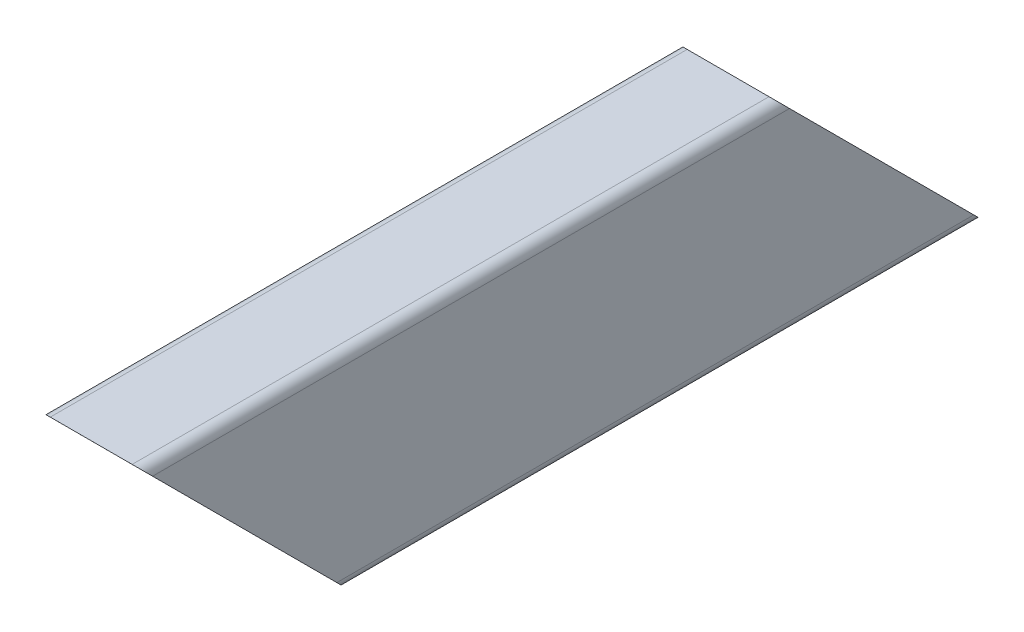
ISO-10303-21;
HEADER;
FILE_DESCRIPTION(('STEP AP214'),'2;1');
FILE_NAME('part.step','',(''),(''),'','','');
FILE_SCHEMA(('AUTOMOTIVE_DESIGN { 1 0 10303 214 1 1 1 1 }'));
ENDSEC;
DATA;
#1=APPLICATION_CONTEXT('core data for automotive mechanical design processes');
#2=APPLICATION_PROTOCOL_DEFINITION('international standard','automotive_design',2000,#1);
#3=PRODUCT_CONTEXT('',#1,'mechanical');
#4=PRODUCT('Part','Part','',(#3));
#5=PRODUCT_RELATED_PRODUCT_CATEGORY('part','',(#4));
#6=PRODUCT_DEFINITION_FORMATION('','',#4);
#7=PRODUCT_DEFINITION_CONTEXT('part definition',#1,'design');
#8=PRODUCT_DEFINITION('design','',#6,#7);
#9=PRODUCT_DEFINITION_SHAPE('','',#8);
#10=(LENGTH_UNIT() NAMED_UNIT(*) SI_UNIT(.MILLI.,.METRE.));
#11=(NAMED_UNIT(*) PLANE_ANGLE_UNIT() SI_UNIT($,.RADIAN.));
#12=(NAMED_UNIT(*) SI_UNIT($,.STERADIAN.) SOLID_ANGLE_UNIT());
#13=UNCERTAINTY_MEASURE_WITH_UNIT(LENGTH_MEASURE(1.E-05),#10,'distance_accuracy_value','');
#14=(GEOMETRIC_REPRESENTATION_CONTEXT(3) GLOBAL_UNCERTAINTY_ASSIGNED_CONTEXT((#13)) GLOBAL_UNIT_ASSIGNED_CONTEXT((#10,
#11,#12)) REPRESENTATION_CONTEXT('',''));
#15=CARTESIAN_POINT('',(0.,0.,0.));
#16=DIRECTION('',(0.,0.,1.));
#17=DIRECTION('',(1.,0.,0.));
#18=AXIS2_PLACEMENT_3D('',#15,#16,#17);
#19=CARTESIAN_POINT('',(-10.0000000000002,47.4999999999999,-205.56));
#20=DIRECTION('',(0.,0.,1.));
#21=DIRECTION('',(1.,0.,0.));
#22=AXIS2_PLACEMENT_3D('',#19,#20,#21);
#23=CYLINDRICAL_SURFACE('',#22,2.50000000000006);
#24=CARTESIAN_POINT('',(-10.0000000000002,47.4999999999999,-2.49650813862906));
#25=DIRECTION('',(0.,0.707106781186546,-0.707106781186549));
#26=DIRECTION('',(0.,0.707106781186549,0.707106781186546));
#27=AXIS2_PLACEMENT_3D('',#24,#25,#26);
#28=ELLIPSE('',#27,3.53553390593281,2.50000000000006);
#29=CARTESIAN_POINT('',(-10.1320875231025,49.9965081386289,0.));
#30=VERTEX_POINT('',#29);
#31=CARTESIAN_POINT('',(-12.5000000000002,47.4999999999999,-2.49650813862902));
#32=VERTEX_POINT('',#31);
#33=EDGE_CURVE('E149',#30,#32,#28,.F.);
#34=ORIENTED_EDGE('',*,*,#33,.F.);
#35=CARTESIAN_POINT('',(-10.0000000000002,47.4999999999999,0.));
#36=DIRECTION('',(0.,0.,1.));
#37=DIRECTION('',(1.,0.,0.));
#38=AXIS2_PLACEMENT_3D('',#35,#36,#37);
#39=CIRCLE('',#38,2.50000000000006);
#40=CARTESIAN_POINT('',(-10.0000000000002,50.,0.));
#41=VERTEX_POINT('',#40);
#42=EDGE_CURVE('E282',#41,#30,#39,.T.);
#43=ORIENTED_EDGE('',*,*,#42,.F.);
#44=DIRECTION('',(0.,0.,1.));
#45=VECTOR('',#44,1.);
#46=CARTESIAN_POINT('',(-10.0000000000002,50.,-205.56));
#47=LINE('',#46,#45);
#48=CARTESIAN_POINT('',(-10.0000000000002,50.0000000000824,-155.559999999445));
#49=VERTEX_POINT('',#48);
#50=EDGE_CURVE('E183',#49,#41,#47,.T.);
#51=ORIENTED_EDGE('',*,*,#50,.F.);
#52=CARTESIAN_POINT('',(-10.0000000000002,47.4999999999999,-158.059999999528));
#53=DIRECTION('',(0.,-0.707106781186546,0.707106781186549));
#54=DIRECTION('',(0.,0.707106781186549,0.707106781186546));
#55=AXIS2_PLACEMENT_3D('',#52,#53,#54);
#56=ELLIPSE('',#55,3.53553390593281,2.50000000000006);
#57=CARTESIAN_POINT('',(-12.5000000000002,47.4999999999999,-158.059999999528));
#58=VERTEX_POINT('',#57);
#59=EDGE_CURVE('E173',#58,#49,#56,.F.);
#60=ORIENTED_EDGE('',*,*,#59,.F.);
#61=DIRECTION('',(0.,0.,1.));
#62=VECTOR('',#61,1.);
#63=CARTESIAN_POINT('',(-12.5000000000002,47.4999999999999,-205.56));
#64=LINE('',#63,#62);
#65=EDGE_CURVE('E166',#58,#32,#64,.T.);
#66=ORIENTED_EDGE('',*,*,#65,.T.);
#67=EDGE_LOOP('',(#34,#43,#51,#60,#66));
#68=FACE_BOUND('',#67,.T.);
#69=ADVANCED_FACE('F34',(#68),#23,.T.);
#70=CARTESIAN_POINT('',(-10.0000000000002,50.,-205.56));
#71=DIRECTION('',(0.,1.,0.));
#72=DIRECTION('',(0.,0.,1.));
#73=AXIS2_PLACEMENT_3D('',#70,#71,#72);
#74=PLANE('',#73);
#75=DIRECTION('',(-1.,0.,0.));
#76=VECTOR('',#75,1.);
#77=CARTESIAN_POINT('',(37.4999999999998,50.0000000000824,-155.559999999445));
#78=LINE('',#77,#76);
#79=CARTESIAN_POINT('',(9.99999999999934,50.0000000000002,-155.559999999528));
#80=VERTEX_POINT('',#79);
#81=EDGE_CURVE('E247',#80,#49,#78,.T.);
#82=ORIENTED_EDGE('',*,*,#81,.T.);
#83=ORIENTED_EDGE('',*,*,#50,.T.);
#84=DIRECTION('',(-1.,0.,0.));
#85=VECTOR('',#84,1.);
#86=CARTESIAN_POINT('',(-10.0000000000002,50.,0.));
#87=LINE('',#86,#85);
#88=CARTESIAN_POINT('',(9.99999999999979,50.,0.));
#89=VERTEX_POINT('',#88);
#90=EDGE_CURVE('E179',#89,#41,#87,.T.);
#91=ORIENTED_EDGE('',*,*,#90,.F.);
#92=DIRECTION('',(0.,0.,1.));
#93=VECTOR('',#92,1.);
#94=CARTESIAN_POINT('',(9.99999999999979,50.,-205.56));
#95=LINE('',#94,#93);
#96=EDGE_CURVE('E188',#80,#89,#95,.T.);
#97=ORIENTED_EDGE('',*,*,#96,.F.);
#98=EDGE_LOOP('',(#82,#83,#91,#97));
#99=FACE_BOUND('',#98,.T.);
#100=ADVANCED_FACE('F308',(#99),#74,.T.);
#101=CARTESIAN_POINT('',(9.99999999999934,47.4999999999999,-205.56));
#102=DIRECTION('',(0.,0.,1.));
#103=DIRECTION('',(1.,0.,0.));
#104=AXIS2_PLACEMENT_3D('',#101,#102,#103);
#105=CYLINDRICAL_SURFACE('',#104,2.50000000000028);
#106=CARTESIAN_POINT('',(9.99999999999934,47.4999999999999,-2.49650813862906));
#107=DIRECTION('',(0.,0.707106781186546,-0.707106781186549));
#108=DIRECTION('',(0.,0.707106781186549,0.707106781186546));
#109=AXIS2_PLACEMENT_3D('',#106,#107,#108);
#110=ELLIPSE('',#109,3.53553390593313,2.50000000000028);
#111=CARTESIAN_POINT('',(12.4999999999996,47.4999999999999,-2.49650813862906));
#112=VERTEX_POINT('',#111);
#113=CARTESIAN_POINT('',(10.1320875231058,49.9965081386289,0.));
#114=VERTEX_POINT('',#113);
#115=EDGE_CURVE('E48',#112,#114,#110,.F.);
#116=ORIENTED_EDGE('',*,*,#115,.F.);
#117=DIRECTION('',(0.,0.,1.));
#118=VECTOR('',#117,1.);
#119=CARTESIAN_POINT('',(12.4999999999996,47.4999999999999,-205.56));
#120=LINE('',#119,#118);
#121=CARTESIAN_POINT('',(12.4999999999997,47.4999999999999,-158.059999999528));
#122=VERTEX_POINT('',#121);
#123=EDGE_CURVE('E194',#122,#112,#120,.T.);
#124=ORIENTED_EDGE('',*,*,#123,.F.);
#125=CARTESIAN_POINT('',(9.99999999999934,47.4999999999999,-158.059999999528));
#126=DIRECTION('',(0.,-0.707106781186546,0.707106781186549));
#127=DIRECTION('',(0.,0.707106781186549,0.707106781186546));
#128=AXIS2_PLACEMENT_3D('',#125,#126,#127);
#129=ELLIPSE('',#128,3.53553390593313,2.50000000000028);
#130=EDGE_CURVE('E275',#80,#122,#129,.F.);
#131=ORIENTED_EDGE('',*,*,#130,.F.);
#132=ORIENTED_EDGE('',*,*,#96,.T.);
#133=CARTESIAN_POINT('',(9.99999999999934,47.4999999999999,0.));
#134=DIRECTION('',(0.,0.,1.));
#135=DIRECTION('',(1.,0.,0.));
#136=AXIS2_PLACEMENT_3D('',#133,#134,#135);
#137=CIRCLE('',#136,2.50000000000028);
#138=EDGE_CURVE('E302',#114,#89,#137,.T.);
#139=ORIENTED_EDGE('',*,*,#138,.F.);
#140=EDGE_LOOP('',(#116,#124,#131,#132,#139));
#141=FACE_BOUND('',#140,.T.);
#142=ADVANCED_FACE('F311',(#141),#105,.T.);
#143=CARTESIAN_POINT('',(12.4999999999997,47.4999999999999,-205.56));
#144=DIRECTION('',(1.,0.,0.));
#145=DIRECTION('',(0.,0.,-1.));
#146=AXIS2_PLACEMENT_3D('',#143,#144,#145);
#147=PLANE('',#146);
#148=DIRECTION('',(0.,0.707106781186549,0.707106781186546));
#149=VECTOR('',#148,1.);
#150=CARTESIAN_POINT('',(12.4999999999997,-54.0317459306856,-104.028254069314));
#151=LINE('',#150,#149);
#152=CARTESIAN_POINT('',(12.4999999999997,2.49999999999995,-47.4965081386288));
#153=VERTEX_POINT('',#152);
#154=EDGE_CURVE('E159',#153,#112,#151,.T.);
#155=ORIENTED_EDGE('',*,*,#154,.F.);
#156=DIRECTION('',(0.,0.,1.));
#157=VECTOR('',#156,1.);
#158=CARTESIAN_POINT('',(12.4999999999997,2.49999999999995,-205.56));
#159=LINE('',#158,#157);
#160=CARTESIAN_POINT('',(12.4999999999997,2.49999999999995,-203.059999999528));
#161=VERTEX_POINT('',#160);
#162=EDGE_CURVE('E201',#161,#153,#159,.T.);
#163=ORIENTED_EDGE('',*,*,#162,.F.);
#164=DIRECTION('',(0.,-0.707106781186549,-0.707106781186546));
#165=VECTOR('',#164,1.);
#166=CARTESIAN_POINT('',(12.4999999999997,23.7499999997638,-181.809999999764));
#167=LINE('',#166,#165);
#168=EDGE_CURVE('E273',#122,#161,#167,.T.);
#169=ORIENTED_EDGE('',*,*,#168,.F.);
#170=ORIENTED_EDGE('',*,*,#123,.T.);
#171=EDGE_LOOP('',(#155,#163,#169,#170));
#172=FACE_BOUND('',#171,.T.);
#173=ADVANCED_FACE('F321',(#172),#147,.T.);
#174=CARTESIAN_POINT('',(9.99999999999934,2.49999999999995,-205.56));
#175=DIRECTION('',(0.,0.,1.));
#176=DIRECTION('',(1.,0.,0.));
#177=AXIS2_PLACEMENT_3D('',#174,#175,#176);
#178=CYLINDRICAL_SURFACE('',#177,2.50000000000017);
#179=CARTESIAN_POINT('',(9.99999999999934,2.49999999999995,-47.4965081386288));
#180=DIRECTION('',(0.,0.707106781186546,-0.707106781186549));
#181=DIRECTION('',(0.,0.707106781186549,0.707106781186546));
#182=AXIS2_PLACEMENT_3D('',#179,#180,#181);
#183=ELLIPSE('',#182,3.53553390593297,2.50000000000017);
#184=CARTESIAN_POINT('',(9.99999999999934,-1.50879309046559E-10,-49.9965081387796));
#185=VERTEX_POINT('',#184);
#186=EDGE_CURVE('E242',#185,#153,#183,.F.);
#187=ORIENTED_EDGE('',*,*,#186,.F.);
#188=DIRECTION('',(0.,0.,1.));
#189=VECTOR('',#188,1.);
#190=CARTESIAN_POINT('',(9.99999999999934,-2.22044604925031E-13,-205.56));
#191=LINE('',#190,#189);
#192=CARTESIAN_POINT('',(9.99999999999934,-2.22044604925031E-13,-205.56));
#193=VERTEX_POINT('',#192);
#194=EDGE_CURVE('E204',#193,#185,#191,.T.);
#195=ORIENTED_EDGE('',*,*,#194,.F.);
#196=CARTESIAN_POINT('',(9.99999999999934,2.49999999999995,-203.059999999528));
#197=DIRECTION('',(0.,-0.707106781186546,0.707106781186549));
#198=DIRECTION('',(0.,0.707106781186549,0.707106781186546));
#199=AXIS2_PLACEMENT_3D('',#196,#197,#198);
#200=ELLIPSE('',#199,3.53553390593297,2.50000000000017);
#201=EDGE_CURVE('E271',#161,#193,#200,.F.);
#202=ORIENTED_EDGE('',*,*,#201,.F.);
#203=ORIENTED_EDGE('',*,*,#162,.T.);
#204=EDGE_LOOP('',(#187,#195,#202,#203));
#205=FACE_BOUND('',#204,.T.);
#206=ADVANCED_FACE('F323',(#205),#178,.T.);
#207=CARTESIAN_POINT('',(9.99999999999934,0.,-205.56));
#208=DIRECTION('',(0.,-1.,0.));
#209=DIRECTION('',(0.,0.,-1.));
#210=AXIS2_PLACEMENT_3D('',#207,#208,#209);
#211=PLANE('',#210);
#212=DIRECTION('',(-1.,0.,0.));
#213=VECTOR('',#212,1.);
#214=CARTESIAN_POINT('',(37.4999999999998,-1.50879309046559E-10,-49.9965081387796));
#215=LINE('',#214,#213);
#216=CARTESIAN_POINT('',(-10.0000000000002,0.,-49.9965081386288));
#217=VERTEX_POINT('',#216);
#218=EDGE_CURVE('E169',#185,#217,#215,.T.);
#219=ORIENTED_EDGE('',*,*,#218,.T.);
#220=DIRECTION('',(0.,0.,1.));
#221=VECTOR('',#220,1.);
#222=CARTESIAN_POINT('',(-10.0000000000002,0.,-205.56));
#223=LINE('',#222,#221);
#224=CARTESIAN_POINT('',(-10.0000000000002,-1.51129109227099E-10,-205.559999999679));
#225=VERTEX_POINT('',#224);
#226=EDGE_CURVE('E176',#225,#217,#223,.T.);
#227=ORIENTED_EDGE('',*,*,#226,.F.);
#228=DIRECTION('',(1.,0.,0.));
#229=VECTOR('',#228,1.);
#230=CARTESIAN_POINT('',(9.99999999999934,0.,-205.56));
#231=LINE('',#230,#229);
#232=EDGE_CURVE('E174',#225,#193,#231,.T.);
#233=ORIENTED_EDGE('',*,*,#232,.T.);
#234=ORIENTED_EDGE('',*,*,#194,.T.);
#235=EDGE_LOOP('',(#219,#227,#233,#234));
#236=FACE_BOUND('',#235,.T.);
#237=ADVANCED_FACE('F215',(#236),#211,.T.);
#238=CARTESIAN_POINT('',(-10.0000000000002,2.49999999999995,-205.56));
#239=DIRECTION('',(0.,0.,1.));
#240=DIRECTION('',(1.,0.,0.));
#241=AXIS2_PLACEMENT_3D('',#238,#239,#240);
#242=CYLINDRICAL_SURFACE('',#241,2.49999999999995);
#243=CARTESIAN_POINT('',(-10.0000000000002,2.49999999999995,-47.4965081386288));
#244=DIRECTION('',(0.,0.707106781186546,-0.707106781186549));
#245=DIRECTION('',(0.,0.707106781186549,0.707106781186546));
#246=AXIS2_PLACEMENT_3D('',#243,#244,#245);
#247=ELLIPSE('',#246,3.53553390593266,2.49999999999995);
#248=CARTESIAN_POINT('',(-12.5000000000002,2.49999999999995,-47.4965081386288));
#249=VERTEX_POINT('',#248);
#250=EDGE_CURVE('E211',#249,#217,#247,.F.);
#251=ORIENTED_EDGE('',*,*,#250,.F.);
#252=DIRECTION('',(0.,0.,1.));
#253=VECTOR('',#252,1.);
#254=CARTESIAN_POINT('',(-12.5000000000002,2.49999999999995,-205.56));
#255=LINE('',#254,#253);
#256=CARTESIAN_POINT('',(-12.5000000000002,2.49999999999996,-203.059999999528));
#257=VERTEX_POINT('',#256);
#258=EDGE_CURVE('E168',#257,#249,#255,.T.);
#259=ORIENTED_EDGE('',*,*,#258,.F.);
#260=CARTESIAN_POINT('',(-10.0000000000002,2.49999999999995,-203.059999999528));
#261=DIRECTION('',(0.,-0.707106781186546,0.707106781186549));
#262=DIRECTION('',(0.,0.707106781186549,0.707106781186546));
#263=AXIS2_PLACEMENT_3D('',#260,#261,#262);
#264=ELLIPSE('',#263,3.53553390593266,2.49999999999995);
#265=EDGE_CURVE('E212',#225,#257,#264,.F.);
#266=ORIENTED_EDGE('',*,*,#265,.F.);
#267=ORIENTED_EDGE('',*,*,#226,.T.);
#268=EDGE_LOOP('',(#251,#259,#266,#267));
#269=FACE_BOUND('',#268,.T.);
#270=ADVANCED_FACE('F210',(#269),#242,.T.);
#271=CARTESIAN_POINT('',(-12.5000000000002,2.49999999999995,-205.56));
#272=DIRECTION('',(-1.,0.,0.));
#273=DIRECTION('',(0.,0.,1.));
#274=AXIS2_PLACEMENT_3D('',#271,#272,#273);
#275=PLANE('',#274);
#276=DIRECTION('',(0.,-0.707106781186549,-0.707106781186546));
#277=VECTOR('',#276,1.);
#278=CARTESIAN_POINT('',(-12.5000000000002,-1.50879309046559E-10,-49.9965081387796));
#279=LINE('',#278,#277);
#280=EDGE_CURVE('E152',#32,#249,#279,.T.);
#281=ORIENTED_EDGE('',*,*,#280,.F.);
#282=ORIENTED_EDGE('',*,*,#65,.F.);
#283=DIRECTION('',(0.,0.707106781186549,0.707106781186546));
#284=VECTOR('',#283,1.);
#285=CARTESIAN_POINT('',(-12.5000000000002,50.0000000000824,-155.559999999445));
#286=LINE('',#285,#284);
#287=EDGE_CURVE('E245',#257,#58,#286,.T.);
#288=ORIENTED_EDGE('',*,*,#287,.F.);
#289=ORIENTED_EDGE('',*,*,#258,.T.);
#290=EDGE_LOOP('',(#281,#282,#288,#289));
#291=FACE_BOUND('',#290,.T.);
#292=ADVANCED_FACE('F164',(#291),#275,.T.);
#293=CARTESIAN_POINT('',(-10.0000000000002,47.4999999999999,0.));
#294=DIRECTION('',(0.,0.,1.));
#295=DIRECTION('',(1.,0.,0.));
#296=AXIS2_PLACEMENT_3D('',#293,#294,#295);
#297=PLANE('',#296);
#298=DIRECTION('',(-1.,0.,0.));
#299=VECTOR('',#298,1.);
#300=CARTESIAN_POINT('',(-10.0000000000002,49.9965081386289,0.));
#301=LINE('',#300,#299);
#302=EDGE_CURVE('E154',#114,#30,#301,.T.);
#303=ORIENTED_EDGE('',*,*,#302,.F.);
#304=ORIENTED_EDGE('',*,*,#138,.T.);
#305=ORIENTED_EDGE('',*,*,#90,.T.);
#306=ORIENTED_EDGE('',*,*,#42,.T.);
#307=EDGE_LOOP('',(#303,#304,#305,#306));
#308=FACE_BOUND('',#307,.T.);
#309=ADVANCED_FACE('F306',(#308),#297,.T.);
#310=CARTESIAN_POINT('',(-7.49999999999984,44.9999999999999,-205.56));
#311=DIRECTION('',(0.,0.,1.));
#312=DIRECTION('',(1.,0.,0.));
#313=AXIS2_PLACEMENT_3D('',#310,#311,#312);
#314=CYLINDRICAL_SURFACE('',#313,2.50000000000017);
#315=DIRECTION('',(0.,0.,1.));
#316=VECTOR('',#315,1.);
#317=CARTESIAN_POINT('',(-7.50000000000028,47.4999999999999,-205.56));
#318=LINE('',#317,#316);
#319=CARTESIAN_POINT('',(-7.50000000000028,47.4999999999999,-158.059999999528));
#320=VERTEX_POINT('',#319);
#321=CARTESIAN_POINT('',(-7.50000000000028,47.4999999999999,-2.49650813862906));
#322=VERTEX_POINT('',#321);
#323=EDGE_CURVE('E279',#320,#322,#318,.T.);
#324=ORIENTED_EDGE('',*,*,#323,.T.);
#325=CARTESIAN_POINT('',(-7.49999999999984,44.9999999999999,-4.99650813862898));
#326=DIRECTION('',(0.,0.707106781186546,-0.707106781186549));
#327=DIRECTION('',(0.,0.707106781186549,0.707106781186546));
#328=AXIS2_PLACEMENT_3D('',#325,#326,#327);
#329=ELLIPSE('',#328,3.53553390593297,2.50000000000017);
#330=CARTESIAN_POINT('',(-10.0000000000002,44.9999999999999,-4.99650813862894));
#331=VERTEX_POINT('',#330);
#332=EDGE_CURVE('E236',#322,#331,#329,.F.);
#333=ORIENTED_EDGE('',*,*,#332,.T.);
#334=DIRECTION('',(0.,0.,1.));
#335=VECTOR('',#334,1.);
#336=CARTESIAN_POINT('',(-10.0000000000002,44.9999999999999,-205.56));
#337=LINE('',#336,#335);
#338=CARTESIAN_POINT('',(-10.0000000000002,44.9999999999999,-160.559999999528));
#339=VERTEX_POINT('',#338);
#340=EDGE_CURVE('E278',#339,#331,#337,.T.);
#341=ORIENTED_EDGE('',*,*,#340,.F.);
#342=CARTESIAN_POINT('',(-7.49999999999984,44.9999999999999,-160.559999999528));
#343=DIRECTION('',(0.,-0.707106781186546,0.707106781186549));
#344=DIRECTION('',(0.,0.707106781186549,0.707106781186546));
#345=AXIS2_PLACEMENT_3D('',#342,#343,#344);
#346=ELLIPSE('',#345,3.53553390593297,2.50000000000017);
#347=EDGE_CURVE('E267',#339,#320,#346,.F.);
#348=ORIENTED_EDGE('',*,*,#347,.T.);
#349=EDGE_LOOP('',(#324,#333,#341,#348));
#350=FACE_BOUND('',#349,.T.);
#351=ADVANCED_FACE('F344',(#350),#314,.F.);
#352=CARTESIAN_POINT('',(-7.50000000000028,47.4999999999999,-205.56));
#353=DIRECTION('',(0.,1.,0.));
#354=DIRECTION('',(0.,0.,1.));
#355=AXIS2_PLACEMENT_3D('',#352,#353,#354);
#356=PLANE('',#355);
#357=DIRECTION('',(0.,0.,1.));
#358=VECTOR('',#357,1.);
#359=CARTESIAN_POINT('',(7.49999999999984,47.4999999999999,-205.56));
#360=LINE('',#359,#358);
#361=CARTESIAN_POINT('',(7.49999999999984,47.4999999999999,-158.059999999528));
#362=VERTEX_POINT('',#361);
#363=CARTESIAN_POINT('',(7.49999999999984,47.4999999999999,-2.49650813862906));
#364=VERTEX_POINT('',#363);
#365=EDGE_CURVE('E283',#362,#364,#360,.T.);
#366=ORIENTED_EDGE('',*,*,#365,.T.);
#367=DIRECTION('',(-1.,0.,0.));
#368=VECTOR('',#367,1.);
#369=CARTESIAN_POINT('',(-7.50000000000028,47.4999999999999,-2.49650813862906));
#370=LINE('',#369,#368);
#371=EDGE_CURVE('E233',#364,#322,#370,.T.);
#372=ORIENTED_EDGE('',*,*,#371,.T.);
#373=ORIENTED_EDGE('',*,*,#323,.F.);
#374=DIRECTION('',(1.,0.,0.));
#375=VECTOR('',#374,1.);
#376=CARTESIAN_POINT('',(-7.50000000000028,47.4999999999999,-158.059999999528));
#377=LINE('',#376,#375);
#378=EDGE_CURVE('E264',#320,#362,#377,.T.);
#379=ORIENTED_EDGE('',*,*,#378,.T.);
#380=EDGE_LOOP('',(#366,#372,#373,#379));
#381=FACE_BOUND('',#380,.T.);
#382=ADVANCED_FACE('F347',(#381),#356,.F.);
#383=CARTESIAN_POINT('',(7.49999999999984,44.9999999999999,-205.56));
#384=DIRECTION('',(0.,0.,1.));
#385=DIRECTION('',(1.,0.,0.));
#386=AXIS2_PLACEMENT_3D('',#383,#384,#385);
#387=CYLINDRICAL_SURFACE('',#386,2.49999999999995);
#388=DIRECTION('',(0.,0.,1.));
#389=VECTOR('',#388,1.);
#390=CARTESIAN_POINT('',(9.99999999999979,44.9999999999999,-205.56));
#391=LINE('',#390,#389);
#392=CARTESIAN_POINT('',(9.99999999999979,44.9999999999999,-160.559999999528));
#393=VERTEX_POINT('',#392);
#394=CARTESIAN_POINT('',(9.99999999999979,44.9999999999999,-4.99650813862894));
#395=VERTEX_POINT('',#394);
#396=EDGE_CURVE('E286',#393,#395,#391,.T.);
#397=ORIENTED_EDGE('',*,*,#396,.T.);
#398=CARTESIAN_POINT('',(7.49999999999984,44.9999999999999,-4.99650813862898));
#399=DIRECTION('',(0.,0.707106781186546,-0.707106781186549));
#400=DIRECTION('',(0.,0.707106781186549,0.707106781186546));
#401=AXIS2_PLACEMENT_3D('',#398,#399,#400);
#402=ELLIPSE('',#401,3.53553390593266,2.49999999999995);
#403=EDGE_CURVE('E230',#395,#364,#402,.F.);
#404=ORIENTED_EDGE('',*,*,#403,.T.);
#405=ORIENTED_EDGE('',*,*,#365,.F.);
#406=CARTESIAN_POINT('',(7.49999999999984,44.9999999999999,-160.559999999528));
#407=DIRECTION('',(0.,-0.707106781186546,0.707106781186549));
#408=DIRECTION('',(0.,0.707106781186549,0.707106781186546));
#409=AXIS2_PLACEMENT_3D('',#406,#407,#408);
#410=ELLIPSE('',#409,3.53553390593266,2.49999999999995);
#411=EDGE_CURVE('E261',#362,#393,#410,.F.);
#412=ORIENTED_EDGE('',*,*,#411,.T.);
#413=EDGE_LOOP('',(#397,#404,#405,#412));
#414=FACE_BOUND('',#413,.T.);
#415=ADVANCED_FACE('F367',(#414),#387,.F.);
#416=CARTESIAN_POINT('',(9.99999999999979,44.9999999999999,-205.56));
#417=DIRECTION('',(1.,0.,0.));
#418=DIRECTION('',(0.,0.,-1.));
#419=AXIS2_PLACEMENT_3D('',#416,#417,#418);
#420=PLANE('',#419);
#421=DIRECTION('',(0.,0.,1.));
#422=VECTOR('',#421,1.);
#423=CARTESIAN_POINT('',(9.99999999999979,4.99999999999989,-205.56));
#424=LINE('',#423,#422);
#425=CARTESIAN_POINT('',(9.99999999999979,4.99999999999989,-200.559999999528));
#426=VERTEX_POINT('',#425);
#427=CARTESIAN_POINT('',(9.99999999999979,4.99999999999989,-44.9965081386289));
#428=VERTEX_POINT('',#427);
#429=EDGE_CURVE('E289',#426,#428,#424,.T.);
#430=ORIENTED_EDGE('',*,*,#429,.T.);
#431=DIRECTION('',(0.,0.707106781186549,0.707106781186546));
#432=VECTOR('',#431,1.);
#433=CARTESIAN_POINT('',(9.99999999999979,-55.2817459306856,-105.278254069314));
#434=LINE('',#433,#432);
#435=EDGE_CURVE('E227',#428,#395,#434,.T.);
#436=ORIENTED_EDGE('',*,*,#435,.T.);
#437=ORIENTED_EDGE('',*,*,#396,.F.);
#438=DIRECTION('',(0.,-0.707106781186549,-0.707106781186546));
#439=VECTOR('',#438,1.);
#440=CARTESIAN_POINT('',(9.99999999999979,22.4999999997638,-183.059999999764));
#441=LINE('',#440,#439);
#442=EDGE_CURVE('E258',#393,#426,#441,.T.);
#443=ORIENTED_EDGE('',*,*,#442,.T.);
#444=EDGE_LOOP('',(#430,#436,#437,#443));
#445=FACE_BOUND('',#444,.T.);
#446=ADVANCED_FACE('F363',(#445),#420,.F.);
#447=CARTESIAN_POINT('',(7.49999999999984,4.99999999999989,-205.56));
#448=DIRECTION('',(0.,0.,1.));
#449=DIRECTION('',(1.,0.,0.));
#450=AXIS2_PLACEMENT_3D('',#447,#448,#449);
#451=CYLINDRICAL_SURFACE('',#450,2.49999999999995);
#452=DIRECTION('',(0.,0.,1.));
#453=VECTOR('',#452,1.);
#454=CARTESIAN_POINT('',(7.49999999999984,2.49999999999995,-205.56));
#455=LINE('',#454,#453);
#456=CARTESIAN_POINT('',(7.49999999999984,2.49999999999995,-203.059999999528));
#457=VERTEX_POINT('',#456);
#458=CARTESIAN_POINT('',(7.49999999999984,2.49999999999995,-47.4965081386288));
#459=VERTEX_POINT('',#458);
#460=EDGE_CURVE('E292',#457,#459,#455,.T.);
#461=ORIENTED_EDGE('',*,*,#460,.T.);
#462=CARTESIAN_POINT('',(7.49999999999984,4.99999999999989,-44.9965081386289));
#463=DIRECTION('',(0.,0.707106781186546,-0.707106781186549));
#464=DIRECTION('',(0.,0.707106781186549,0.707106781186546));
#465=AXIS2_PLACEMENT_3D('',#462,#463,#464);
#466=ELLIPSE('',#465,3.53553390593266,2.49999999999995);
#467=EDGE_CURVE('E224',#459,#428,#466,.F.);
#468=ORIENTED_EDGE('',*,*,#467,.T.);
#469=ORIENTED_EDGE('',*,*,#429,.F.);
#470=CARTESIAN_POINT('',(7.49999999999984,4.99999999999989,-200.559999999528));
#471=DIRECTION('',(0.,-0.707106781186546,0.707106781186549));
#472=DIRECTION('',(0.,0.707106781186549,0.707106781186546));
#473=AXIS2_PLACEMENT_3D('',#470,#471,#472);
#474=ELLIPSE('',#473,3.53553390593266,2.49999999999995);
#475=EDGE_CURVE('E255',#426,#457,#474,.F.);
#476=ORIENTED_EDGE('',*,*,#475,.T.);
#477=EDGE_LOOP('',(#461,#468,#469,#476));
#478=FACE_BOUND('',#477,.T.);
#479=ADVANCED_FACE('F359',(#478),#451,.F.);
#480=CARTESIAN_POINT('',(7.49999999999984,2.49999999999995,-205.56));
#481=DIRECTION('',(0.,-1.,0.));
#482=DIRECTION('',(0.,0.,-1.));
#483=AXIS2_PLACEMENT_3D('',#480,#481,#482);
#484=PLANE('',#483);
#485=DIRECTION('',(0.,0.,1.));
#486=VECTOR('',#485,1.);
#487=CARTESIAN_POINT('',(-7.50000000000028,2.49999999999995,-205.56));
#488=LINE('',#487,#486);
#489=CARTESIAN_POINT('',(-7.50000000000028,2.49999999999995,-203.059999999528));
#490=VERTEX_POINT('',#489);
#491=CARTESIAN_POINT('',(-7.50000000000028,2.49999999999995,-47.4965081386288));
#492=VERTEX_POINT('',#491);
#493=EDGE_CURVE('E295',#490,#492,#488,.T.);
#494=ORIENTED_EDGE('',*,*,#493,.T.);
#495=DIRECTION('',(1.,0.,0.));
#496=VECTOR('',#495,1.);
#497=CARTESIAN_POINT('',(7.49999999999984,2.49999999999995,-47.4965081386288));
#498=LINE('',#497,#496);
#499=EDGE_CURVE('E219',#492,#459,#498,.T.);
#500=ORIENTED_EDGE('',*,*,#499,.T.);
#501=ORIENTED_EDGE('',*,*,#460,.F.);
#502=DIRECTION('',(-1.,0.,0.));
#503=VECTOR('',#502,1.);
#504=CARTESIAN_POINT('',(7.49999999999984,2.49999999999995,-203.059999999528));
#505=LINE('',#504,#503);
#506=EDGE_CURVE('E252',#457,#490,#505,.T.);
#507=ORIENTED_EDGE('',*,*,#506,.T.);
#508=EDGE_LOOP('',(#494,#500,#501,#507));
#509=FACE_BOUND('',#508,.T.);
#510=ADVANCED_FACE('F355',(#509),#484,.F.);
#511=CARTESIAN_POINT('',(-7.49999999999984,4.99999999999989,-205.56));
#512=DIRECTION('',(0.,0.,1.));
#513=DIRECTION('',(1.,0.,0.));
#514=AXIS2_PLACEMENT_3D('',#511,#512,#513);
#515=CYLINDRICAL_SURFACE('',#514,2.50000000000017);
#516=DIRECTION('',(0.,0.,1.));
#517=VECTOR('',#516,1.);
#518=CARTESIAN_POINT('',(-10.,4.99999999999989,-205.56));
#519=LINE('',#518,#517);
#520=CARTESIAN_POINT('',(-10.0000000000002,4.99999999999989,-200.559999999528));
#521=VERTEX_POINT('',#520);
#522=CARTESIAN_POINT('',(-10.0000000000001,4.99999999999989,-44.9965081386289));
#523=VERTEX_POINT('',#522);
#524=EDGE_CURVE('E298',#521,#523,#519,.T.);
#525=ORIENTED_EDGE('',*,*,#524,.T.);
#526=CARTESIAN_POINT('',(-7.49999999999984,4.99999999999989,-44.9965081386289));
#527=DIRECTION('',(0.,0.707106781186546,-0.707106781186549));
#528=DIRECTION('',(0.,0.707106781186549,0.707106781186546));
#529=AXIS2_PLACEMENT_3D('',#526,#527,#528);
#530=ELLIPSE('',#529,3.53553390593297,2.50000000000017);
#531=EDGE_CURVE('E56',#523,#492,#530,.F.);
#532=ORIENTED_EDGE('',*,*,#531,.T.);
#533=ORIENTED_EDGE('',*,*,#493,.F.);
#534=CARTESIAN_POINT('',(-7.49999999999984,4.99999999999989,-200.559999999528));
#535=DIRECTION('',(0.,-0.707106781186546,0.707106781186549));
#536=DIRECTION('',(0.,0.707106781186549,0.707106781186546));
#537=AXIS2_PLACEMENT_3D('',#534,#535,#536);
#538=ELLIPSE('',#537,3.53553390593297,2.50000000000017);
#539=EDGE_CURVE('E249',#490,#521,#538,.F.);
#540=ORIENTED_EDGE('',*,*,#539,.T.);
#541=EDGE_LOOP('',(#525,#532,#533,#540));
#542=FACE_BOUND('',#541,.T.);
#543=ADVANCED_FACE('F352',(#542),#515,.F.);
#544=CARTESIAN_POINT('',(-10.0000000000002,4.99999999999989,-205.56));
#545=DIRECTION('',(-1.,0.,0.));
#546=DIRECTION('',(0.,0.,1.));
#547=AXIS2_PLACEMENT_3D('',#544,#545,#546);
#548=PLANE('',#547);
#549=ORIENTED_EDGE('',*,*,#340,.T.);
#550=DIRECTION('',(0.,-0.707106781186549,-0.707106781186546));
#551=VECTOR('',#550,1.);
#552=CARTESIAN_POINT('',(-10.0000000000002,-75.2817459306857,-125.278254069314));
#553=LINE('',#552,#551);
#554=EDGE_CURVE('E11',#331,#523,#553,.T.);
#555=ORIENTED_EDGE('',*,*,#554,.T.);
#556=ORIENTED_EDGE('',*,*,#524,.F.);
#557=DIRECTION('',(0.,0.707106781186549,0.707106781186546));
#558=VECTOR('',#557,1.);
#559=CARTESIAN_POINT('',(-10.0000000000002,2.49999999976373,-203.059999999764));
#560=LINE('',#559,#558);
#561=EDGE_CURVE('E41',#521,#339,#560,.T.);
#562=ORIENTED_EDGE('',*,*,#561,.T.);
#563=EDGE_LOOP('',(#549,#555,#556,#562));
#564=FACE_BOUND('',#563,.T.);
#565=ADVANCED_FACE('F349',(#564),#548,.F.);
#566=CARTESIAN_POINT('',(37.4999999999998,50.0000000000824,-155.559999999445));
#567=DIRECTION('',(0.,-0.707106781186546,0.707106781186549));
#568=DIRECTION('',(0.,-0.707106781186549,-0.707106781186546));
#569=AXIS2_PLACEMENT_3D('',#566,#567,#568);
#570=PLANE('',#569);
#571=ORIENTED_EDGE('',*,*,#59,.T.);
#572=ORIENTED_EDGE('',*,*,#81,.F.);
#573=ORIENTED_EDGE('',*,*,#130,.T.);
#574=ORIENTED_EDGE('',*,*,#168,.T.);
#575=ORIENTED_EDGE('',*,*,#201,.T.);
#576=ORIENTED_EDGE('',*,*,#232,.F.);
#577=ORIENTED_EDGE('',*,*,#265,.T.);
#578=ORIENTED_EDGE('',*,*,#287,.T.);
#579=EDGE_LOOP('',(#571,#572,#573,#574,#575,#576,#577,#578));
#580=FACE_BOUND('',#579,.T.);
#581=ORIENTED_EDGE('',*,*,#561,.F.);
#582=ORIENTED_EDGE('',*,*,#539,.F.);
#583=ORIENTED_EDGE('',*,*,#506,.F.);
#584=ORIENTED_EDGE('',*,*,#475,.F.);
#585=ORIENTED_EDGE('',*,*,#442,.F.);
#586=ORIENTED_EDGE('',*,*,#411,.F.);
#587=ORIENTED_EDGE('',*,*,#378,.F.);
#588=ORIENTED_EDGE('',*,*,#347,.F.);
#589=EDGE_LOOP('',(#581,#582,#583,#584,#585,#586,#587,#588));
#590=FACE_BOUND('',#589,.T.);
#591=ADVANCED_FACE('F315',(#580,#590),#570,.F.);
#592=CARTESIAN_POINT('',(37.4999999999998,-1.50879309046559E-10,-49.9965081387796));
#593=DIRECTION('',(0.,0.707106781186546,-0.707106781186549));
#594=DIRECTION('',(0.,0.707106781186549,0.707106781186546));
#595=AXIS2_PLACEMENT_3D('',#592,#593,#594);
#596=PLANE('',#595);
#597=ORIENTED_EDGE('',*,*,#250,.T.);
#598=ORIENTED_EDGE('',*,*,#218,.F.);
#599=ORIENTED_EDGE('',*,*,#186,.T.);
#600=ORIENTED_EDGE('',*,*,#154,.T.);
#601=ORIENTED_EDGE('',*,*,#115,.T.);
#602=ORIENTED_EDGE('',*,*,#302,.T.);
#603=ORIENTED_EDGE('',*,*,#33,.T.);
#604=ORIENTED_EDGE('',*,*,#280,.T.);
#605=EDGE_LOOP('',(#597,#598,#599,#600,#601,#602,#603,#604));
#606=FACE_BOUND('',#605,.T.);
#607=ORIENTED_EDGE('',*,*,#371,.F.);
#608=ORIENTED_EDGE('',*,*,#403,.F.);
#609=ORIENTED_EDGE('',*,*,#435,.F.);
#610=ORIENTED_EDGE('',*,*,#467,.F.);
#611=ORIENTED_EDGE('',*,*,#499,.F.);
#612=ORIENTED_EDGE('',*,*,#531,.F.);
#613=ORIENTED_EDGE('',*,*,#554,.F.);
#614=ORIENTED_EDGE('',*,*,#332,.F.);
#615=EDGE_LOOP('',(#607,#608,#609,#610,#611,#612,#613,#614));
#616=FACE_BOUND('',#615,.T.);
#617=ADVANCED_FACE('F151',(#606,#616),#596,.F.);
#618=CLOSED_SHELL('',(#69,#100,#142,#173,#206,#237,#270,#292,#309,#351,#382,#415,#446,#479,#510,
#543,#565,#591,#617));
#619=MANIFOLD_SOLID_BREP('B2',#618);
#620=ADVANCED_BREP_SHAPE_REPRESENTATION('',(#18,#619),#14);
#621=SHAPE_DEFINITION_REPRESENTATION(#9,#620);
ENDSEC;
END-ISO-10303-21;
